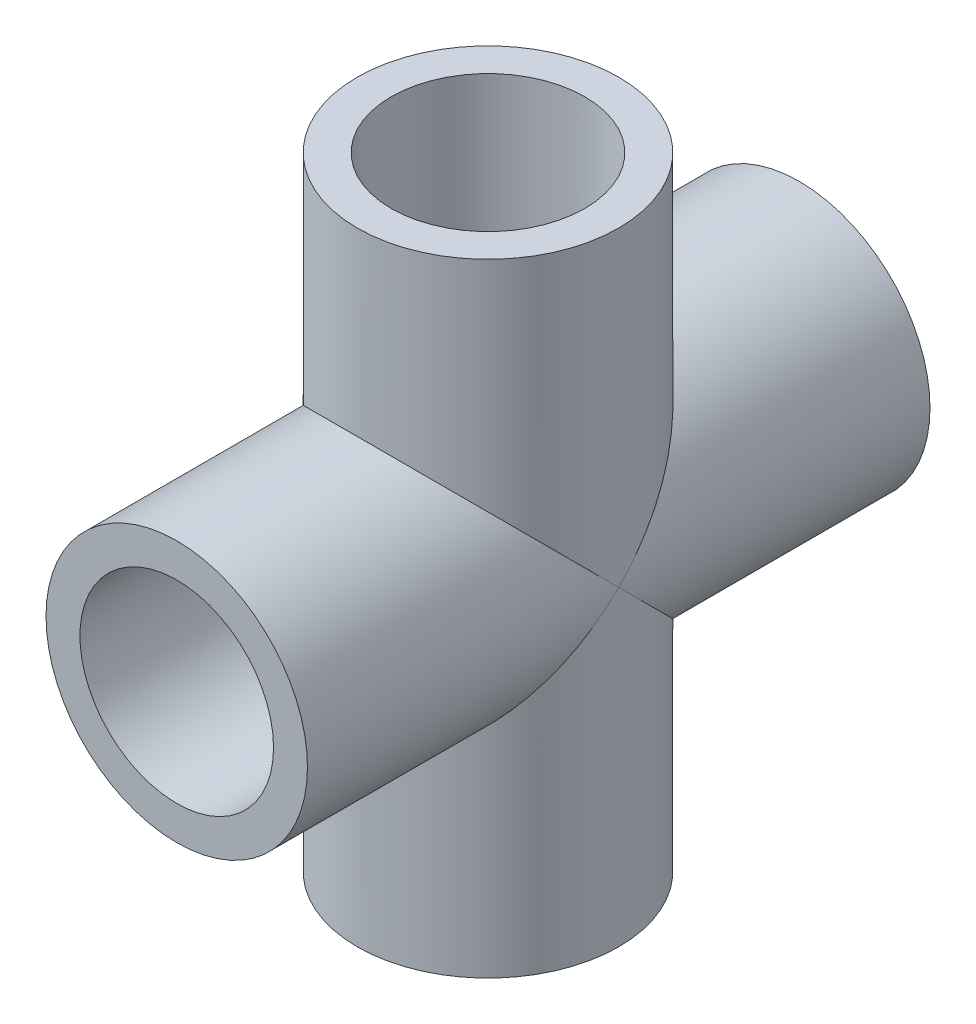
ISO-10303-21;
HEADER;
FILE_DESCRIPTION(('STEP AP214'),'2;1');
FILE_NAME('part.step','',(''),(''),'','','');
FILE_SCHEMA(('AUTOMOTIVE_DESIGN { 1 0 10303 214 1 1 1 1 }'));
ENDSEC;
DATA;
#1=APPLICATION_CONTEXT('core data for automotive mechanical design processes');
#2=APPLICATION_PROTOCOL_DEFINITION('international standard','automotive_design',2000,#1);
#3=PRODUCT_CONTEXT('',#1,'mechanical');
#4=PRODUCT('Part','Part','',(#3));
#5=PRODUCT_RELATED_PRODUCT_CATEGORY('part','',(#4));
#6=PRODUCT_DEFINITION_FORMATION('','',#4);
#7=PRODUCT_DEFINITION_CONTEXT('part definition',#1,'design');
#8=PRODUCT_DEFINITION('design','',#6,#7);
#9=PRODUCT_DEFINITION_SHAPE('','',#8);
#10=(LENGTH_UNIT() NAMED_UNIT(*) SI_UNIT(.MILLI.,.METRE.));
#11=(NAMED_UNIT(*) PLANE_ANGLE_UNIT() SI_UNIT($,.RADIAN.));
#12=(NAMED_UNIT(*) SI_UNIT($,.STERADIAN.) SOLID_ANGLE_UNIT());
#13=UNCERTAINTY_MEASURE_WITH_UNIT(LENGTH_MEASURE(1.E-05),#10,'distance_accuracy_value','');
#14=(GEOMETRIC_REPRESENTATION_CONTEXT(3) GLOBAL_UNCERTAINTY_ASSIGNED_CONTEXT((#13)) GLOBAL_UNIT_ASSIGNED_CONTEXT((#10,
#11,#12)) REPRESENTATION_CONTEXT('',''));
#15=CARTESIAN_POINT('',(0.,0.,0.));
#16=DIRECTION('',(0.,0.,1.));
#17=DIRECTION('',(1.,0.,0.));
#18=AXIS2_PLACEMENT_3D('',#15,#16,#17);
#19=CARTESIAN_POINT('',(0.,0.,50.8));
#20=DIRECTION('',(0.,0.,-1.));
#21=DIRECTION('',(-1.,0.,0.));
#22=AXIS2_PLACEMENT_3D('',#19,#20,#21);
#23=CYLINDRICAL_SURFACE('',#22,7.8994);
#24=CARTESIAN_POINT('',(0.,0.,25.4));
#25=DIRECTION('',(0.,0.707106781186547,-0.707106781186547));
#26=DIRECTION('',(0.,-0.707106781186547,-0.707106781186547));
#27=AXIS2_PLACEMENT_3D('',#24,#25,#26);
#28=ELLIPSE('',#27,11.17143861461,7.8994);
#29=CARTESIAN_POINT('',(7.8994,0.,25.4));
#30=VERTEX_POINT('',#29);
#31=CARTESIAN_POINT('',(-7.8994,0.,25.4));
#32=VERTEX_POINT('',#31);
#33=EDGE_CURVE('E11',#30,#32,#28,.F.);
#34=ORIENTED_EDGE('',*,*,#33,.F.);
#35=CARTESIAN_POINT('',(0.,0.,25.4));
#36=DIRECTION('',(0.,-0.707106781186547,-0.707106781186547));
#37=DIRECTION('',(0.,0.707106781186547,-0.707106781186547));
#38=AXIS2_PLACEMENT_3D('',#35,#36,#37);
#39=ELLIPSE('',#38,11.17143861461,7.8994);
#40=EDGE_CURVE('E46',#32,#30,#39,.F.);
#41=ORIENTED_EDGE('',*,*,#40,.F.);
#42=EDGE_LOOP('',(#34,#41));
#43=FACE_BOUND('',#42,.T.);
#44=CARTESIAN_POINT('',(0.,0.,50.8));
#45=DIRECTION('',(0.,0.,1.));
#46=DIRECTION('',(1.,0.,0.));
#47=AXIS2_PLACEMENT_3D('',#44,#45,#46);
#48=CIRCLE('',#47,7.8994);
#49=CARTESIAN_POINT('',(7.8994,0.,50.8));
#50=VERTEX_POINT('',#49);
#51=EDGE_CURVE('E78',#50,#50,#48,.T.);
#52=ORIENTED_EDGE('',*,*,#51,.T.);
#53=EDGE_LOOP('',(#52));
#54=FACE_BOUND('',#53,.T.);
#55=ADVANCED_FACE('F32',(#43,#54),#23,.F.);
#56=CARTESIAN_POINT('',(0.,0.,50.8));
#57=DIRECTION('',(0.,0.,-1.));
#58=DIRECTION('',(-1.,0.,0.));
#59=AXIS2_PLACEMENT_3D('',#56,#57,#58);
#60=CYLINDRICAL_SURFACE('',#59,10.668);
#61=CARTESIAN_POINT('',(0.,0.,50.8));
#62=DIRECTION('',(0.,0.,1.));
#63=DIRECTION('',(1.,0.,0.));
#64=AXIS2_PLACEMENT_3D('',#61,#62,#63);
#65=CIRCLE('',#64,10.668);
#66=CARTESIAN_POINT('',(10.668,0.,50.8));
#67=VERTEX_POINT('',#66);
#68=EDGE_CURVE('E69',#67,#67,#65,.T.);
#69=ORIENTED_EDGE('',*,*,#68,.F.);
#70=EDGE_LOOP('',(#69));
#71=FACE_BOUND('',#70,.T.);
#72=CARTESIAN_POINT('',(0.,0.,25.4));
#73=DIRECTION('',(0.,-0.707106781186547,-0.707106781186547));
#74=DIRECTION('',(0.,0.707106781186547,-0.707106781186547));
#75=AXIS2_PLACEMENT_3D('',#72,#73,#74);
#76=ELLIPSE('',#75,15.0868302833962,10.668);
#77=CARTESIAN_POINT('',(10.668,0.,25.4));
#78=VERTEX_POINT('',#77);
#79=CARTESIAN_POINT('',(-10.668,0.,25.4));
#80=VERTEX_POINT('',#79);
#81=EDGE_CURVE('E89',#78,#80,#76,.T.);
#82=ORIENTED_EDGE('',*,*,#81,.F.);
#83=CARTESIAN_POINT('',(0.,0.,25.4));
#84=DIRECTION('',(0.,0.707106781186547,-0.707106781186547));
#85=DIRECTION('',(0.,-0.707106781186547,-0.707106781186547));
#86=AXIS2_PLACEMENT_3D('',#83,#84,#85);
#87=ELLIPSE('',#86,15.0868302833962,10.668);
#88=EDGE_CURVE('E91',#80,#78,#87,.T.);
#89=ORIENTED_EDGE('',*,*,#88,.F.);
#90=EDGE_LOOP('',(#82,#89));
#91=FACE_BOUND('',#90,.T.);
#92=ADVANCED_FACE('F119',(#71,#91),#60,.T.);
#93=CARTESIAN_POINT('',(0.,0.,50.8));
#94=DIRECTION('',(0.,0.,1.));
#95=DIRECTION('',(1.,0.,0.));
#96=AXIS2_PLACEMENT_3D('',#93,#94,#95);
#97=PLANE('',#96);
#98=ORIENTED_EDGE('',*,*,#68,.T.);
#99=EDGE_LOOP('',(#98));
#100=FACE_BOUND('',#99,.T.);
#101=ORIENTED_EDGE('',*,*,#51,.F.);
#102=EDGE_LOOP('',(#101));
#103=FACE_BOUND('',#102,.T.);
#104=ADVANCED_FACE('F128',(#100,#103),#97,.T.);
#105=CARTESIAN_POINT('',(0.,25.4,25.4));
#106=DIRECTION('',(0.,-1.,0.));
#107=DIRECTION('',(0.,0.,-1.));
#108=AXIS2_PLACEMENT_3D('',#105,#106,#107);
#109=CYLINDRICAL_SURFACE('',#108,10.668);
#110=CARTESIAN_POINT('',(0.,-25.4,25.4));
#111=DIRECTION('',(0.,1.,0.));
#112=DIRECTION('',(0.,0.,1.));
#113=AXIS2_PLACEMENT_3D('',#110,#111,#112);
#114=CIRCLE('',#113,10.668);
#115=CARTESIAN_POINT('',(0.,-25.4,36.068));
#116=VERTEX_POINT('',#115);
#117=EDGE_CURVE('E96',#116,#116,#114,.T.);
#118=ORIENTED_EDGE('',*,*,#117,.T.);
#119=EDGE_LOOP('',(#118));
#120=FACE_BOUND('',#119,.T.);
#121=CARTESIAN_POINT('',(0.,0.,25.4));
#122=DIRECTION('',(0.,0.707106781186547,-0.707106781186547));
#123=DIRECTION('',(0.,-0.707106781186547,-0.707106781186547));
#124=AXIS2_PLACEMENT_3D('',#121,#122,#123);
#125=ELLIPSE('',#124,15.0868302833962,10.668);
#126=EDGE_CURVE('E53',#80,#78,#125,.F.);
#127=ORIENTED_EDGE('',*,*,#126,.T.);
#128=ORIENTED_EDGE('',*,*,#81,.T.);
#129=EDGE_LOOP('',(#127,#128));
#130=FACE_BOUND('',#129,.T.);
#131=ADVANCED_FACE('F142',(#120,#130),#109,.T.);
#132=CARTESIAN_POINT('',(0.,-25.4,25.4));
#133=DIRECTION('',(0.,1.,0.));
#134=DIRECTION('',(0.,0.,1.));
#135=AXIS2_PLACEMENT_3D('',#132,#133,#134);
#136=PLANE('',#135);
#137=ORIENTED_EDGE('',*,*,#117,.F.);
#138=EDGE_LOOP('',(#137));
#139=FACE_BOUND('',#138,.T.);
#140=CARTESIAN_POINT('',(0.,-25.4,25.4));
#141=DIRECTION('',(0.,1.,0.));
#142=DIRECTION('',(0.,0.,1.));
#143=AXIS2_PLACEMENT_3D('',#140,#141,#142);
#144=CIRCLE('',#143,7.8994);
#145=CARTESIAN_POINT('',(0.,-25.4,33.2994));
#146=VERTEX_POINT('',#145);
#147=EDGE_CURVE('E102',#146,#146,#144,.T.);
#148=ORIENTED_EDGE('',*,*,#147,.T.);
#149=EDGE_LOOP('',(#148));
#150=FACE_BOUND('',#149,.T.);
#151=ADVANCED_FACE('F147',(#139,#150),#136,.F.);
#152=CARTESIAN_POINT('',(0.,25.4,25.4));
#153=DIRECTION('',(0.,-1.,0.));
#154=DIRECTION('',(0.,0.,-1.));
#155=AXIS2_PLACEMENT_3D('',#152,#153,#154);
#156=CYLINDRICAL_SURFACE('',#155,7.8994);
#157=ORIENTED_EDGE('',*,*,#147,.F.);
#158=EDGE_LOOP('',(#157));
#159=FACE_BOUND('',#158,.T.);
#160=CARTESIAN_POINT('',(0.,0.,25.4));
#161=DIRECTION('',(0.,0.707106781186547,-0.707106781186547));
#162=DIRECTION('',(0.,-0.707106781186547,-0.707106781186547));
#163=AXIS2_PLACEMENT_3D('',#160,#161,#162);
#164=ELLIPSE('',#163,11.17143861461,7.8994);
#165=EDGE_CURVE('E40',#30,#32,#164,.T.);
#166=ORIENTED_EDGE('',*,*,#165,.T.);
#167=ORIENTED_EDGE('',*,*,#40,.T.);
#168=EDGE_LOOP('',(#166,#167));
#169=FACE_BOUND('',#168,.T.);
#170=ADVANCED_FACE('F68',(#159,#169),#156,.F.);
#171=CARTESIAN_POINT('',(0.,25.4,25.4));
#172=DIRECTION('',(0.,1.,0.));
#173=DIRECTION('',(0.,0.,1.));
#174=AXIS2_PLACEMENT_3D('',#171,#172,#173);
#175=CIRCLE('',#174,10.668);
#176=CARTESIAN_POINT('',(0.,25.4,36.068));
#177=VERTEX_POINT('',#176);
#178=EDGE_CURVE('E95',#177,#177,#175,.T.);
#179=ORIENTED_EDGE('',*,*,#178,.F.);
#180=EDGE_LOOP('',(#179));
#181=FACE_BOUND('',#180,.T.);
#182=ORIENTED_EDGE('',*,*,#88,.T.);
#183=CARTESIAN_POINT('',(0.,0.,25.4));
#184=DIRECTION('',(0.,-0.707106781186547,-0.707106781186547));
#185=DIRECTION('',(0.,0.707106781186547,-0.707106781186547));
#186=AXIS2_PLACEMENT_3D('',#183,#184,#185);
#187=ELLIPSE('',#186,15.0868302833962,10.668);
#188=EDGE_CURVE('E84',#78,#80,#187,.F.);
#189=ORIENTED_EDGE('',*,*,#188,.T.);
#190=EDGE_LOOP('',(#182,#189));
#191=FACE_BOUND('',#190,.T.);
#192=ADVANCED_FACE('F120',(#181,#191),#109,.T.);
#193=CARTESIAN_POINT('',(0.,25.4,25.4));
#194=DIRECTION('',(0.,1.,0.));
#195=DIRECTION('',(0.,0.,1.));
#196=AXIS2_PLACEMENT_3D('',#193,#194,#195);
#197=CIRCLE('',#196,7.8994);
#198=CARTESIAN_POINT('',(0.,25.4,33.2994));
#199=VERTEX_POINT('',#198);
#200=EDGE_CURVE('E99',#199,#199,#197,.T.);
#201=ORIENTED_EDGE('',*,*,#200,.T.);
#202=EDGE_LOOP('',(#201));
#203=FACE_BOUND('',#202,.T.);
#204=ORIENTED_EDGE('',*,*,#33,.T.);
#205=CARTESIAN_POINT('',(0.,0.,25.4));
#206=DIRECTION('',(0.,-0.707106781186547,-0.707106781186547));
#207=DIRECTION('',(0.,0.707106781186547,-0.707106781186547));
#208=AXIS2_PLACEMENT_3D('',#205,#206,#207);
#209=ELLIPSE('',#208,11.17143861461,7.8994);
#210=EDGE_CURVE('E62',#32,#30,#209,.T.);
#211=ORIENTED_EDGE('',*,*,#210,.T.);
#212=EDGE_LOOP('',(#204,#211));
#213=FACE_BOUND('',#212,.T.);
#214=ADVANCED_FACE('F63',(#203,#213),#156,.F.);
#215=CARTESIAN_POINT('',(0.,25.4,25.4));
#216=DIRECTION('',(0.,1.,0.));
#217=DIRECTION('',(0.,0.,1.));
#218=AXIS2_PLACEMENT_3D('',#215,#216,#217);
#219=PLANE('',#218);
#220=ORIENTED_EDGE('',*,*,#178,.T.);
#221=EDGE_LOOP('',(#220));
#222=FACE_BOUND('',#221,.T.);
#223=ORIENTED_EDGE('',*,*,#200,.F.);
#224=EDGE_LOOP('',(#223));
#225=FACE_BOUND('',#224,.T.);
#226=ADVANCED_FACE('F109',(#222,#225),#219,.T.);
#227=CARTESIAN_POINT('',(0.,0.,0.));
#228=DIRECTION('',(0.,0.,1.));
#229=DIRECTION('',(1.,0.,0.));
#230=AXIS2_PLACEMENT_3D('',#227,#228,#229);
#231=CIRCLE('',#230,10.668);
#232=CARTESIAN_POINT('',(10.668,0.,0.));
#233=VERTEX_POINT('',#232);
#234=EDGE_CURVE('E75',#233,#233,#231,.T.);
#235=ORIENTED_EDGE('',*,*,#234,.T.);
#236=EDGE_LOOP('',(#235));
#237=FACE_BOUND('',#236,.T.);
#238=ORIENTED_EDGE('',*,*,#188,.F.);
#239=ORIENTED_EDGE('',*,*,#126,.F.);
#240=EDGE_LOOP('',(#238,#239));
#241=FACE_BOUND('',#240,.T.);
#242=ADVANCED_FACE('F34',(#237,#241),#60,.T.);
#243=CARTESIAN_POINT('',(0.,0.,0.));
#244=DIRECTION('',(0.,0.,1.));
#245=DIRECTION('',(1.,0.,0.));
#246=AXIS2_PLACEMENT_3D('',#243,#244,#245);
#247=PLANE('',#246);
#248=ORIENTED_EDGE('',*,*,#234,.F.);
#249=EDGE_LOOP('',(#248));
#250=FACE_BOUND('',#249,.T.);
#251=CARTESIAN_POINT('',(0.,0.,0.));
#252=DIRECTION('',(0.,0.,1.));
#253=DIRECTION('',(1.,0.,0.));
#254=AXIS2_PLACEMENT_3D('',#251,#252,#253);
#255=CIRCLE('',#254,7.8994);
#256=CARTESIAN_POINT('',(7.8994,0.,0.));
#257=VERTEX_POINT('',#256);
#258=EDGE_CURVE('E81',#257,#257,#255,.T.);
#259=ORIENTED_EDGE('',*,*,#258,.T.);
#260=EDGE_LOOP('',(#259));
#261=FACE_BOUND('',#260,.T.);
#262=ADVANCED_FACE('F117',(#250,#261),#247,.F.);
#263=ORIENTED_EDGE('',*,*,#165,.F.);
#264=ORIENTED_EDGE('',*,*,#210,.F.);
#265=EDGE_LOOP('',(#263,#264));
#266=FACE_BOUND('',#265,.T.);
#267=ORIENTED_EDGE('',*,*,#258,.F.);
#268=EDGE_LOOP('',(#267));
#269=FACE_BOUND('',#268,.T.);
#270=ADVANCED_FACE('F72',(#266,#269),#23,.F.);
#271=CLOSED_SHELL('',(#55,#92,#104,#131,#151,#170,#192,#214,#226,#242,#262,#270));
#272=MANIFOLD_SOLID_BREP('B2',#271);
#273=ADVANCED_BREP_SHAPE_REPRESENTATION('',(#18,#272),#14);
#274=SHAPE_DEFINITION_REPRESENTATION(#9,#273);
ENDSEC;
END-ISO-10303-21;
